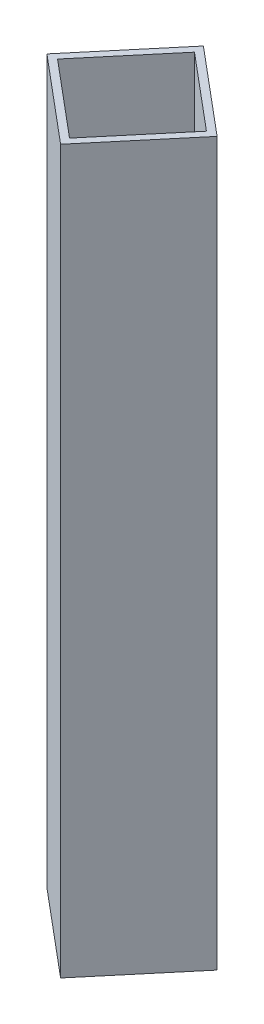
ISO-10303-21;
HEADER;
FILE_DESCRIPTION(('STEP AP214'),'2;1');
FILE_NAME('part.step','',(''),(''),'','','');
FILE_SCHEMA(('AUTOMOTIVE_DESIGN { 1 0 10303 214 1 1 1 1 }'));
ENDSEC;
DATA;
#1=APPLICATION_CONTEXT('core data for automotive mechanical design processes');
#2=APPLICATION_PROTOCOL_DEFINITION('international standard','automotive_design',2000,#1);
#3=PRODUCT_CONTEXT('',#1,'mechanical');
#4=PRODUCT('Part','Part','',(#3));
#5=PRODUCT_RELATED_PRODUCT_CATEGORY('part','',(#4));
#6=PRODUCT_DEFINITION_FORMATION('','',#4);
#7=PRODUCT_DEFINITION_CONTEXT('part definition',#1,'design');
#8=PRODUCT_DEFINITION('design','',#6,#7);
#9=PRODUCT_DEFINITION_SHAPE('','',#8);
#10=(LENGTH_UNIT() NAMED_UNIT(*) SI_UNIT(.MILLI.,.METRE.));
#11=(NAMED_UNIT(*) PLANE_ANGLE_UNIT() SI_UNIT($,.RADIAN.));
#12=(NAMED_UNIT(*) SI_UNIT($,.STERADIAN.) SOLID_ANGLE_UNIT());
#13=UNCERTAINTY_MEASURE_WITH_UNIT(LENGTH_MEASURE(1.E-05),#10,'distance_accuracy_value','');
#14=(GEOMETRIC_REPRESENTATION_CONTEXT(3) GLOBAL_UNCERTAINTY_ASSIGNED_CONTEXT((#13)) GLOBAL_UNIT_ASSIGNED_CONTEXT((#10,
#11,#12)) REPRESENTATION_CONTEXT('',''));
#15=CARTESIAN_POINT('',(0.,0.,0.));
#16=DIRECTION('',(0.,0.,1.));
#17=DIRECTION('',(1.,0.,0.));
#18=AXIS2_PLACEMENT_3D('',#15,#16,#17);
#19=CARTESIAN_POINT('',(278.112903575089,165.1,293.109429165724));
#20=DIRECTION('',(-0.64278760968654,0.,0.766044443118978));
#21=DIRECTION('',(0.766044443118978,0.,0.64278760968654));
#22=AXIS2_PLACEMENT_3D('',#19,#20,#21);
#23=PLANE('',#22);
#24=DIRECTION('',(-0.766044443118978,0.,-0.64278760968654));
#25=VECTOR('',#24,1.);
#26=CARTESIAN_POINT('',(278.112903575089,-165.1,293.109429165724));
#27=LINE('',#26,#25);
#28=CARTESIAN_POINT('',(433.512024242808,-165.1,423.504774003282));
#29=VERTEX_POINT('',#28);
#30=CARTESIAN_POINT('',(394.596966532365,-165.1,390.851163431206));
#31=VERTEX_POINT('',#30);
#32=EDGE_CURVE('E158',#29,#31,#27,.T.);
#33=ORIENTED_EDGE('',*,*,#32,.F.);
#34=DIRECTION('',(0.,-1.,0.));
#35=VECTOR('',#34,1.);
#36=CARTESIAN_POINT('',(433.512024242808,165.1,423.504774003282));
#37=LINE('',#36,#35);
#38=CARTESIAN_POINT('',(433.512024242808,165.1,423.504774003282));
#39=VERTEX_POINT('',#38);
#40=EDGE_CURVE('E11',#39,#29,#37,.T.);
#41=ORIENTED_EDGE('',*,*,#40,.F.);
#42=DIRECTION('',(-0.766044443118978,0.,-0.64278760968654));
#43=VECTOR('',#42,1.);
#44=CARTESIAN_POINT('',(278.112903575089,165.1,293.109429165724));
#45=LINE('',#44,#43);
#46=CARTESIAN_POINT('',(394.596966532365,165.1,390.851163431206));
#47=VERTEX_POINT('',#46);
#48=EDGE_CURVE('E118',#39,#47,#45,.T.);
#49=ORIENTED_EDGE('',*,*,#48,.T.);
#50=DIRECTION('',(0.,-1.,0.));
#51=VECTOR('',#50,1.);
#52=CARTESIAN_POINT('',(394.596966532365,165.1,390.851163431206));
#53=LINE('',#52,#51);
#54=EDGE_CURVE('E85',#47,#31,#53,.T.);
#55=ORIENTED_EDGE('',*,*,#54,.T.);
#56=EDGE_LOOP('',(#33,#41,#49,#55));
#57=FACE_BOUND('',#56,.T.);
#58=ADVANCED_FACE('F16',(#57),#23,.T.);
#59=CARTESIAN_POINT('',(444.568371127719,165.1,410.328332882224));
#60=DIRECTION('',(-0.766044443118978,0.,-0.64278760968654));
#61=DIRECTION('',(-0.64278760968654,0.,0.766044443118978));
#62=AXIS2_PLACEMENT_3D('',#59,#60,#61);
#63=PLANE('',#62);
#64=DIRECTION('',(0.64278760968654,0.,-0.766044443118978));
#65=VECTOR('',#64,1.);
#66=CARTESIAN_POINT('',(444.568371127719,-165.1,410.328332882224));
#67=LINE('',#66,#65);
#68=CARTESIAN_POINT('',(466.165634814885,-165.1,384.589716292838));
#69=VERTEX_POINT('',#68);
#70=EDGE_CURVE('E125',#29,#69,#67,.T.);
#71=ORIENTED_EDGE('',*,*,#70,.T.);
#72=DIRECTION('',(0.,-1.,0.));
#73=VECTOR('',#72,1.);
#74=CARTESIAN_POINT('',(466.165634814885,165.1,384.589716292838));
#75=LINE('',#74,#73);
#76=CARTESIAN_POINT('',(466.165634814885,165.1,384.589716292838));
#77=VERTEX_POINT('',#76);
#78=EDGE_CURVE('E27',#77,#69,#75,.T.);
#79=ORIENTED_EDGE('',*,*,#78,.F.);
#80=DIRECTION('',(0.64278760968654,0.,-0.766044443118978));
#81=VECTOR('',#80,1.);
#82=CARTESIAN_POINT('',(444.568371127719,165.1,410.328332882224));
#83=LINE('',#82,#81);
#84=EDGE_CURVE('E113',#39,#77,#83,.T.);
#85=ORIENTED_EDGE('',*,*,#84,.F.);
#86=ORIENTED_EDGE('',*,*,#40,.T.);
#87=EDGE_LOOP('',(#71,#79,#85,#86));
#88=FACE_BOUND('',#87,.T.);
#89=ADVANCED_FACE('F123',(#88),#63,.F.);
#90=CARTESIAN_POINT('',(360.587988116179,165.1,295.999551887389));
#91=DIRECTION('',(0.64278760968654,0.,-0.766044443118978));
#92=DIRECTION('',(-0.766044443118978,0.,-0.64278760968654));
#93=AXIS2_PLACEMENT_3D('',#90,#91,#92);
#94=PLANE('',#93);
#95=DIRECTION('',(0.766044443118978,0.,0.64278760968654));
#96=VECTOR('',#95,1.);
#97=CARTESIAN_POINT('',(360.587988116179,-165.1,295.999551887389));
#98=LINE('',#97,#96);
#99=CARTESIAN_POINT('',(427.250577104441,-165.1,351.936105720762));
#100=VERTEX_POINT('',#99);
#101=EDGE_CURVE('E164',#100,#69,#98,.T.);
#102=ORIENTED_EDGE('',*,*,#101,.F.);
#103=DIRECTION('',(0.,-1.,0.));
#104=VECTOR('',#103,1.);
#105=CARTESIAN_POINT('',(427.250577104441,165.1,351.936105720762));
#106=LINE('',#105,#104);
#107=CARTESIAN_POINT('',(427.250577104441,165.1,351.936105720762));
#108=VERTEX_POINT('',#107);
#109=EDGE_CURVE('E76',#108,#100,#106,.T.);
#110=ORIENTED_EDGE('',*,*,#109,.F.);
#111=DIRECTION('',(0.766044443118978,0.,0.64278760968654));
#112=VECTOR('',#111,1.);
#113=CARTESIAN_POINT('',(360.587988116179,165.1,295.999551887389));
#114=LINE('',#113,#112);
#115=EDGE_CURVE('E117',#108,#77,#114,.T.);
#116=ORIENTED_EDGE('',*,*,#115,.T.);
#117=ORIENTED_EDGE('',*,*,#78,.T.);
#118=EDGE_LOOP('',(#102,#110,#116,#117));
#119=FACE_BOUND('',#118,.T.);
#120=ADVANCED_FACE('F131',(#119),#94,.T.);
#121=CARTESIAN_POINT('',(442.136180020816,165.1,408.287482221469));
#122=DIRECTION('',(-0.766044443118978,0.,-0.64278760968654));
#123=DIRECTION('',(-0.64278760968654,0.,0.766044443118978));
#124=AXIS2_PLACEMENT_3D('',#121,#122,#123);
#125=PLANE('',#124);
#126=DIRECTION('',(0.64278760968654,0.,-0.766044443118978));
#127=VECTOR('',#126,1.);
#128=CARTESIAN_POINT('',(442.136180020816,-165.1,408.287482221469));
#129=LINE('',#128,#127);
#130=CARTESIAN_POINT('',(433.120683796661,-165.1,419.031732235625));
#131=VERTEX_POINT('',#130);
#132=CARTESIAN_POINT('',(461.692593047227,-165.1,384.981056738986));
#133=VERTEX_POINT('',#132);
#134=EDGE_CURVE('E142',#131,#133,#129,.T.);
#135=ORIENTED_EDGE('',*,*,#134,.F.);
#136=DIRECTION('',(0.,-1.,0.));
#137=VECTOR('',#136,1.);
#138=CARTESIAN_POINT('',(433.120683796661,165.1,419.031732235625));
#139=LINE('',#138,#137);
#140=CARTESIAN_POINT('',(433.120683796661,165.1,419.031732235625));
#141=VERTEX_POINT('',#140);
#142=EDGE_CURVE('E20',#141,#131,#139,.T.);
#143=ORIENTED_EDGE('',*,*,#142,.F.);
#144=DIRECTION('',(0.64278760968654,0.,-0.766044443118978));
#145=VECTOR('',#144,1.);
#146=CARTESIAN_POINT('',(442.136180020816,165.1,408.287482221469));
#147=LINE('',#146,#145);
#148=CARTESIAN_POINT('',(461.692593047227,165.1,384.981056738986));
#149=VERTEX_POINT('',#148);
#150=EDGE_CURVE('E168',#141,#149,#147,.T.);
#151=ORIENTED_EDGE('',*,*,#150,.T.);
#152=DIRECTION('',(0.,-1.,0.));
#153=VECTOR('',#152,1.);
#154=CARTESIAN_POINT('',(461.692593047227,165.1,384.981056738986));
#155=LINE('',#154,#153);
#156=EDGE_CURVE('E138',#149,#133,#155,.T.);
#157=ORIENTED_EDGE('',*,*,#156,.T.);
#158=EDGE_LOOP('',(#135,#143,#151,#157));
#159=FACE_BOUND('',#158,.T.);
#160=ADVANCED_FACE('F18',(#159),#125,.T.);
#161=CARTESIAN_POINT('',(653.412206777253,165.1,603.878267920121));
#162=DIRECTION('',(0.64278760968654,0.,-0.766044443118978));
#163=DIRECTION('',(-0.766044443118978,0.,-0.64278760968654));
#164=AXIS2_PLACEMENT_3D('',#161,#162,#163);
#165=PLANE('',#164);
#166=DIRECTION('',(0.766044443118978,0.,0.64278760968654));
#167=VECTOR('',#166,1.);
#168=CARTESIAN_POINT('',(653.412206777253,-165.1,603.878267920121));
#169=LINE('',#168,#167);
#170=CARTESIAN_POINT('',(399.070008300022,-165.1,390.459822985058));
#171=VERTEX_POINT('',#170);
#172=EDGE_CURVE('E146',#171,#131,#169,.T.);
#173=ORIENTED_EDGE('',*,*,#172,.F.);
#174=DIRECTION('',(0.,-1.,0.));
#175=VECTOR('',#174,1.);
#176=CARTESIAN_POINT('',(399.070008300022,165.1,390.459822985058));
#177=LINE('',#176,#175);
#178=CARTESIAN_POINT('',(399.070008300022,165.1,390.459822985058));
#179=VERTEX_POINT('',#178);
#180=EDGE_CURVE('E177',#179,#171,#177,.T.);
#181=ORIENTED_EDGE('',*,*,#180,.F.);
#182=DIRECTION('',(0.766044443118978,0.,0.64278760968654));
#183=VECTOR('',#182,1.);
#184=CARTESIAN_POINT('',(653.412206777253,165.1,603.878267920121));
#185=LINE('',#184,#183);
#186=EDGE_CURVE('E190',#179,#141,#185,.T.);
#187=ORIENTED_EDGE('',*,*,#186,.T.);
#188=ORIENTED_EDGE('',*,*,#142,.T.);
#189=EDGE_LOOP('',(#173,#181,#187,#188));
#190=FACE_BOUND('',#189,.T.);
#191=ADVANCED_FACE('F188',(#190),#165,.T.);
#192=CARTESIAN_POINT('',(413.355962925306,165.1,373.434485236739));
#193=DIRECTION('',(0.766044443118978,0.,0.64278760968654));
#194=DIRECTION('',(0.64278760968654,0.,-0.766044443118978));
#195=AXIS2_PLACEMENT_3D('',#192,#193,#194);
#196=PLANE('',#195);
#197=DIRECTION('',(-0.64278760968654,0.,0.766044443118978));
#198=VECTOR('',#197,1.);
#199=CARTESIAN_POINT('',(413.355962925306,-165.1,373.434485236739));
#200=LINE('',#199,#198);
#201=CARTESIAN_POINT('',(427.641917550589,-165.1,356.40914748842));
#202=VERTEX_POINT('',#201);
#203=EDGE_CURVE('E150',#202,#171,#200,.T.);
#204=ORIENTED_EDGE('',*,*,#203,.F.);
#205=DIRECTION('',(0.,-1.,0.));
#206=VECTOR('',#205,1.);
#207=CARTESIAN_POINT('',(427.641917550589,165.1,356.40914748842));
#208=LINE('',#207,#206);
#209=CARTESIAN_POINT('',(427.641917550589,165.1,356.40914748842));
#210=VERTEX_POINT('',#209);
#211=EDGE_CURVE('E175',#210,#202,#208,.T.);
#212=ORIENTED_EDGE('',*,*,#211,.F.);
#213=DIRECTION('',(-0.64278760968654,0.,0.766044443118978));
#214=VECTOR('',#213,1.);
#215=CARTESIAN_POINT('',(413.355962925306,165.1,373.434485236739));
#216=LINE('',#215,#214);
#217=EDGE_CURVE('E197',#210,#179,#216,.T.);
#218=ORIENTED_EDGE('',*,*,#217,.T.);
#219=ORIENTED_EDGE('',*,*,#180,.T.);
#220=EDGE_LOOP('',(#204,#212,#218,#219));
#221=FACE_BOUND('',#220,.T.);
#222=ADVANCED_FACE('F195',(#221),#196,.T.);
#223=CARTESIAN_POINT('',(683.020069785306,165.1,570.696860839306));
#224=DIRECTION('',(-0.64278760968654,0.,0.766044443118978));
#225=DIRECTION('',(0.766044443118978,0.,0.64278760968654));
#226=AXIS2_PLACEMENT_3D('',#223,#224,#225);
#227=PLANE('',#226);
#228=DIRECTION('',(-0.766044443118978,0.,-0.64278760968654));
#229=VECTOR('',#228,1.);
#230=CARTESIAN_POINT('',(683.020069785306,-165.1,570.696860839306));
#231=LINE('',#230,#229);
#232=EDGE_CURVE('E154',#133,#202,#231,.T.);
#233=ORIENTED_EDGE('',*,*,#232,.F.);
#234=ORIENTED_EDGE('',*,*,#156,.F.);
#235=DIRECTION('',(-0.766044443118978,0.,-0.64278760968654));
#236=VECTOR('',#235,1.);
#237=CARTESIAN_POINT('',(683.020069785306,165.1,570.696860839306));
#238=LINE('',#237,#236);
#239=EDGE_CURVE('E202',#149,#210,#238,.T.);
#240=ORIENTED_EDGE('',*,*,#239,.T.);
#241=ORIENTED_EDGE('',*,*,#211,.T.);
#242=EDGE_LOOP('',(#233,#234,#240,#241));
#243=FACE_BOUND('',#242,.T.);
#244=ADVANCED_FACE('F205',(#243),#227,.T.);
#245=CARTESIAN_POINT('',(410.923771818402,165.1,371.393634575984));
#246=DIRECTION('',(0.766044443118978,0.,0.64278760968654));
#247=DIRECTION('',(0.64278760968654,0.,-0.766044443118978));
#248=AXIS2_PLACEMENT_3D('',#245,#246,#247);
#249=PLANE('',#248);
#250=DIRECTION('',(-0.64278760968654,0.,0.766044443118978));
#251=VECTOR('',#250,1.);
#252=CARTESIAN_POINT('',(410.923771818402,-165.1,371.393634575984));
#253=LINE('',#252,#251);
#254=EDGE_CURVE('E166',#100,#31,#253,.T.);
#255=ORIENTED_EDGE('',*,*,#254,.T.);
#256=ORIENTED_EDGE('',*,*,#54,.F.);
#257=DIRECTION('',(-0.64278760968654,0.,0.766044443118978));
#258=VECTOR('',#257,1.);
#259=CARTESIAN_POINT('',(410.923771818402,165.1,371.393634575984));
#260=LINE('',#259,#258);
#261=EDGE_CURVE('E41',#108,#47,#260,.T.);
#262=ORIENTED_EDGE('',*,*,#261,.F.);
#263=ORIENTED_EDGE('',*,*,#109,.T.);
#264=EDGE_LOOP('',(#255,#256,#262,#263));
#265=FACE_BOUND('',#264,.T.);
#266=ADVANCED_FACE('F242',(#265),#249,.F.);
#267=CARTESIAN_POINT('',(705.053366952356,165.1,637.655198226429));
#268=DIRECTION('',(0.,1.,0.));
#269=DIRECTION('',(-1.,0.,0.));
#270=AXIS2_PLACEMENT_3D('',#267,#268,#269);
#271=PLANE('',#270);
#272=ORIENTED_EDGE('',*,*,#150,.F.);
#273=ORIENTED_EDGE('',*,*,#186,.F.);
#274=ORIENTED_EDGE('',*,*,#217,.F.);
#275=ORIENTED_EDGE('',*,*,#239,.F.);
#276=EDGE_LOOP('',(#272,#273,#274,#275));
#277=FACE_BOUND('',#276,.T.);
#278=ORIENTED_EDGE('',*,*,#48,.F.);
#279=ORIENTED_EDGE('',*,*,#84,.T.);
#280=ORIENTED_EDGE('',*,*,#115,.F.);
#281=ORIENTED_EDGE('',*,*,#261,.T.);
#282=EDGE_LOOP('',(#278,#279,#280,#281));
#283=FACE_BOUND('',#282,.T.);
#284=ADVANCED_FACE('F115',(#277,#283),#271,.T.);
#285=CARTESIAN_POINT('',(705.053366952356,-165.1,637.655198226429));
#286=DIRECTION('',(0.,1.,0.));
#287=DIRECTION('',(-1.,0.,0.));
#288=AXIS2_PLACEMENT_3D('',#285,#286,#287);
#289=PLANE('',#288);
#290=ORIENTED_EDGE('',*,*,#134,.T.);
#291=ORIENTED_EDGE('',*,*,#232,.T.);
#292=ORIENTED_EDGE('',*,*,#203,.T.);
#293=ORIENTED_EDGE('',*,*,#172,.T.);
#294=EDGE_LOOP('',(#290,#291,#292,#293));
#295=FACE_BOUND('',#294,.T.);
#296=ORIENTED_EDGE('',*,*,#32,.T.);
#297=ORIENTED_EDGE('',*,*,#254,.F.);
#298=ORIENTED_EDGE('',*,*,#101,.T.);
#299=ORIENTED_EDGE('',*,*,#70,.F.);
#300=EDGE_LOOP('',(#296,#297,#298,#299));
#301=FACE_BOUND('',#300,.T.);
#302=ADVANCED_FACE('F193',(#295,#301),#289,.F.);
#303=CLOSED_SHELL('',(#58,#89,#120,#160,#191,#222,#244,#266,#284,#302));
#304=MANIFOLD_SOLID_BREP('B1',#303);
#305=ADVANCED_BREP_SHAPE_REPRESENTATION('',(#18,#304),#14);
#306=SHAPE_DEFINITION_REPRESENTATION(#9,#305);
ENDSEC;
END-ISO-10303-21;
